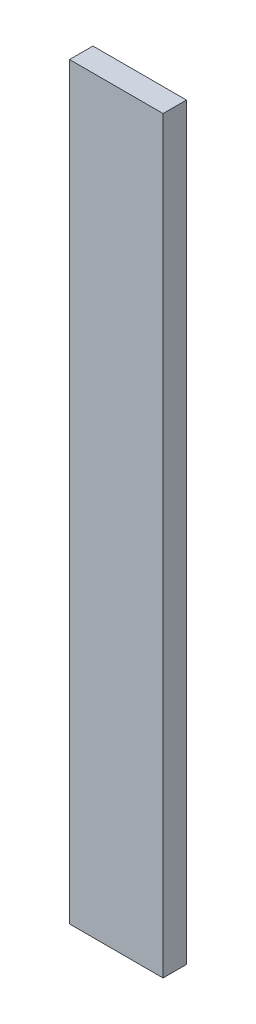
ISO-10303-21;
HEADER;
FILE_DESCRIPTION(('STEP AP214'),'2;1');
FILE_NAME('part.step','',(''),(''),'','','');
FILE_SCHEMA(('AUTOMOTIVE_DESIGN { 1 0 10303 214 1 1 1 1 }'));
ENDSEC;
DATA;
#1=APPLICATION_CONTEXT('core data for automotive mechanical design processes');
#2=APPLICATION_PROTOCOL_DEFINITION('international standard','automotive_design',2000,#1);
#3=PRODUCT_CONTEXT('',#1,'mechanical');
#4=PRODUCT('Part','Part','',(#3));
#5=PRODUCT_RELATED_PRODUCT_CATEGORY('part','',(#4));
#6=PRODUCT_DEFINITION_FORMATION('','',#4);
#7=PRODUCT_DEFINITION_CONTEXT('part definition',#1,'design');
#8=PRODUCT_DEFINITION('design','',#6,#7);
#9=PRODUCT_DEFINITION_SHAPE('','',#8);
#10=(LENGTH_UNIT() NAMED_UNIT(*) SI_UNIT(.MILLI.,.METRE.));
#11=(NAMED_UNIT(*) PLANE_ANGLE_UNIT() SI_UNIT($,.RADIAN.));
#12=(NAMED_UNIT(*) SI_UNIT($,.STERADIAN.) SOLID_ANGLE_UNIT());
#13=UNCERTAINTY_MEASURE_WITH_UNIT(LENGTH_MEASURE(1.E-05),#10,'distance_accuracy_value','');
#14=(GEOMETRIC_REPRESENTATION_CONTEXT(3) GLOBAL_UNCERTAINTY_ASSIGNED_CONTEXT((#13)) GLOBAL_UNIT_ASSIGNED_CONTEXT((#10,
#11,#12)) REPRESENTATION_CONTEXT('',''));
#15=CARTESIAN_POINT('',(0.,0.,0.));
#16=DIRECTION('',(0.,0.,1.));
#17=DIRECTION('',(1.,0.,0.));
#18=AXIS2_PLACEMENT_3D('',#15,#16,#17);
#19=CARTESIAN_POINT('',(0.,0.,3.175));
#20=DIRECTION('',(0.,0.,1.));
#21=DIRECTION('',(1.,0.,0.));
#22=AXIS2_PLACEMENT_3D('',#19,#20,#21);
#23=PLANE('',#22);
#24=DIRECTION('',(1.,0.,0.));
#25=VECTOR('',#24,1.);
#26=CARTESIAN_POINT('',(6.35,50.8,3.175));
#27=LINE('',#26,#25);
#28=CARTESIAN_POINT('',(-6.35,50.8,3.175));
#29=VERTEX_POINT('',#28);
#30=CARTESIAN_POINT('',(6.35,50.8,3.175));
#31=VERTEX_POINT('',#30);
#32=EDGE_CURVE('E68',#29,#31,#27,.T.);
#33=ORIENTED_EDGE('',*,*,#32,.F.);
#34=DIRECTION('',(0.,1.,0.));
#35=VECTOR('',#34,1.);
#36=CARTESIAN_POINT('',(-6.35,50.8,3.175));
#37=LINE('',#36,#35);
#38=CARTESIAN_POINT('',(-6.35,-50.8,3.175));
#39=VERTEX_POINT('',#38);
#40=EDGE_CURVE('E20',#39,#29,#37,.T.);
#41=ORIENTED_EDGE('',*,*,#40,.F.);
#42=DIRECTION('',(1.,0.,0.));
#43=VECTOR('',#42,1.);
#44=CARTESIAN_POINT('',(-6.35,-50.8,3.175));
#45=LINE('',#44,#43);
#46=CARTESIAN_POINT('',(6.35,-50.8,3.175));
#47=VERTEX_POINT('',#46);
#48=EDGE_CURVE('E58',#47,#39,#45,.F.);
#49=ORIENTED_EDGE('',*,*,#48,.F.);
#50=DIRECTION('',(0.,1.,0.));
#51=VECTOR('',#50,1.);
#52=CARTESIAN_POINT('',(6.35,-50.8,3.175));
#53=LINE('',#52,#51);
#54=EDGE_CURVE('E53',#31,#47,#53,.F.);
#55=ORIENTED_EDGE('',*,*,#54,.F.);
#56=EDGE_LOOP('',(#33,#41,#49,#55));
#57=FACE_BOUND('',#56,.T.);
#58=ADVANCED_FACE('F17',(#57),#23,.T.);
#59=CARTESIAN_POINT('',(-6.35,50.8,0.));
#60=DIRECTION('',(-1.,0.,0.));
#61=DIRECTION('',(0.,0.,1.));
#62=AXIS2_PLACEMENT_3D('',#59,#60,#61);
#63=PLANE('',#62);
#64=DIRECTION('',(0.,0.,1.));
#65=VECTOR('',#64,1.);
#66=CARTESIAN_POINT('',(-6.35,50.8,0.));
#67=LINE('',#66,#65);
#68=CARTESIAN_POINT('',(-6.35,50.8,0.));
#69=VERTEX_POINT('',#68);
#70=EDGE_CURVE('E79',#69,#29,#67,.T.);
#71=ORIENTED_EDGE('',*,*,#70,.F.);
#72=DIRECTION('',(0.,1.,0.));
#73=VECTOR('',#72,1.);
#74=CARTESIAN_POINT('',(-6.35,0.,0.));
#75=LINE('',#74,#73);
#76=CARTESIAN_POINT('',(-6.35,-50.8,0.));
#77=VERTEX_POINT('',#76);
#78=EDGE_CURVE('E74',#69,#77,#75,.F.);
#79=ORIENTED_EDGE('',*,*,#78,.T.);
#80=DIRECTION('',(0.,0.,-1.));
#81=VECTOR('',#80,1.);
#82=CARTESIAN_POINT('',(-6.35,-50.8,0.));
#83=LINE('',#82,#81);
#84=EDGE_CURVE('E63',#39,#77,#83,.T.);
#85=ORIENTED_EDGE('',*,*,#84,.F.);
#86=ORIENTED_EDGE('',*,*,#40,.T.);
#87=EDGE_LOOP('',(#71,#79,#85,#86));
#88=FACE_BOUND('',#87,.T.);
#89=ADVANCED_FACE('F73',(#88),#63,.T.);
#90=CARTESIAN_POINT('',(-6.35,-50.8,0.));
#91=DIRECTION('',(0.,-1.,0.));
#92=DIRECTION('',(0.,0.,-1.));
#93=AXIS2_PLACEMENT_3D('',#90,#91,#92);
#94=PLANE('',#93);
#95=ORIENTED_EDGE('',*,*,#84,.T.);
#96=DIRECTION('',(1.,0.,0.));
#97=VECTOR('',#96,1.);
#98=CARTESIAN_POINT('',(0.,-50.8,0.));
#99=LINE('',#98,#97);
#100=CARTESIAN_POINT('',(6.35,-50.8,0.));
#101=VERTEX_POINT('',#100);
#102=EDGE_CURVE('E84',#77,#101,#99,.T.);
#103=ORIENTED_EDGE('',*,*,#102,.T.);
#104=DIRECTION('',(0.,0.,-1.));
#105=VECTOR('',#104,1.);
#106=CARTESIAN_POINT('',(6.35,-50.8,0.));
#107=LINE('',#106,#105);
#108=EDGE_CURVE('E65',#47,#101,#107,.T.);
#109=ORIENTED_EDGE('',*,*,#108,.F.);
#110=ORIENTED_EDGE('',*,*,#48,.T.);
#111=EDGE_LOOP('',(#95,#103,#109,#110));
#112=FACE_BOUND('',#111,.T.);
#113=ADVANCED_FACE('F60',(#112),#94,.T.);
#114=CARTESIAN_POINT('',(6.35,-50.8,0.));
#115=DIRECTION('',(1.,0.,0.));
#116=DIRECTION('',(0.,0.,-1.));
#117=AXIS2_PLACEMENT_3D('',#114,#115,#116);
#118=PLANE('',#117);
#119=ORIENTED_EDGE('',*,*,#108,.T.);
#120=DIRECTION('',(0.,1.,0.));
#121=VECTOR('',#120,1.);
#122=CARTESIAN_POINT('',(6.35,0.,0.));
#123=LINE('',#122,#121);
#124=CARTESIAN_POINT('',(6.35,50.8,0.));
#125=VERTEX_POINT('',#124);
#126=EDGE_CURVE('E26',#101,#125,#123,.T.);
#127=ORIENTED_EDGE('',*,*,#126,.T.);
#128=DIRECTION('',(0.,0.,1.));
#129=VECTOR('',#128,1.);
#130=CARTESIAN_POINT('',(6.35,50.8,0.));
#131=LINE('',#130,#129);
#132=EDGE_CURVE('E34',#31,#125,#131,.F.);
#133=ORIENTED_EDGE('',*,*,#132,.F.);
#134=ORIENTED_EDGE('',*,*,#54,.T.);
#135=EDGE_LOOP('',(#119,#127,#133,#134));
#136=FACE_BOUND('',#135,.T.);
#137=ADVANCED_FACE('F88',(#136),#118,.T.);
#138=CARTESIAN_POINT('',(6.35,50.8,0.));
#139=DIRECTION('',(0.,1.,0.));
#140=DIRECTION('',(0.,0.,1.));
#141=AXIS2_PLACEMENT_3D('',#138,#139,#140);
#142=PLANE('',#141);
#143=ORIENTED_EDGE('',*,*,#132,.T.);
#144=DIRECTION('',(1.,0.,0.));
#145=VECTOR('',#144,1.);
#146=CARTESIAN_POINT('',(0.,50.8,0.));
#147=LINE('',#146,#145);
#148=EDGE_CURVE('E11',#125,#69,#147,.F.);
#149=ORIENTED_EDGE('',*,*,#148,.T.);
#150=ORIENTED_EDGE('',*,*,#70,.T.);
#151=ORIENTED_EDGE('',*,*,#32,.T.);
#152=EDGE_LOOP('',(#143,#149,#150,#151));
#153=FACE_BOUND('',#152,.T.);
#154=ADVANCED_FACE('F91',(#153),#142,.T.);
#155=CARTESIAN_POINT('',(0.,0.,0.));
#156=DIRECTION('',(0.,0.,1.));
#157=DIRECTION('',(1.,0.,0.));
#158=AXIS2_PLACEMENT_3D('',#155,#156,#157);
#159=PLANE('',#158);
#160=ORIENTED_EDGE('',*,*,#126,.F.);
#161=ORIENTED_EDGE('',*,*,#102,.F.);
#162=ORIENTED_EDGE('',*,*,#78,.F.);
#163=ORIENTED_EDGE('',*,*,#148,.F.);
#164=EDGE_LOOP('',(#160,#161,#162,#163));
#165=FACE_BOUND('',#164,.T.);
#166=ADVANCED_FACE('F90',(#165),#159,.F.);
#167=CLOSED_SHELL('',(#58,#89,#113,#137,#154,#166));
#168=MANIFOLD_SOLID_BREP('B1',#167);
#169=ADVANCED_BREP_SHAPE_REPRESENTATION('',(#18,#168),#14);
#170=SHAPE_DEFINITION_REPRESENTATION(#9,#169);
ENDSEC;
END-ISO-10303-21;
